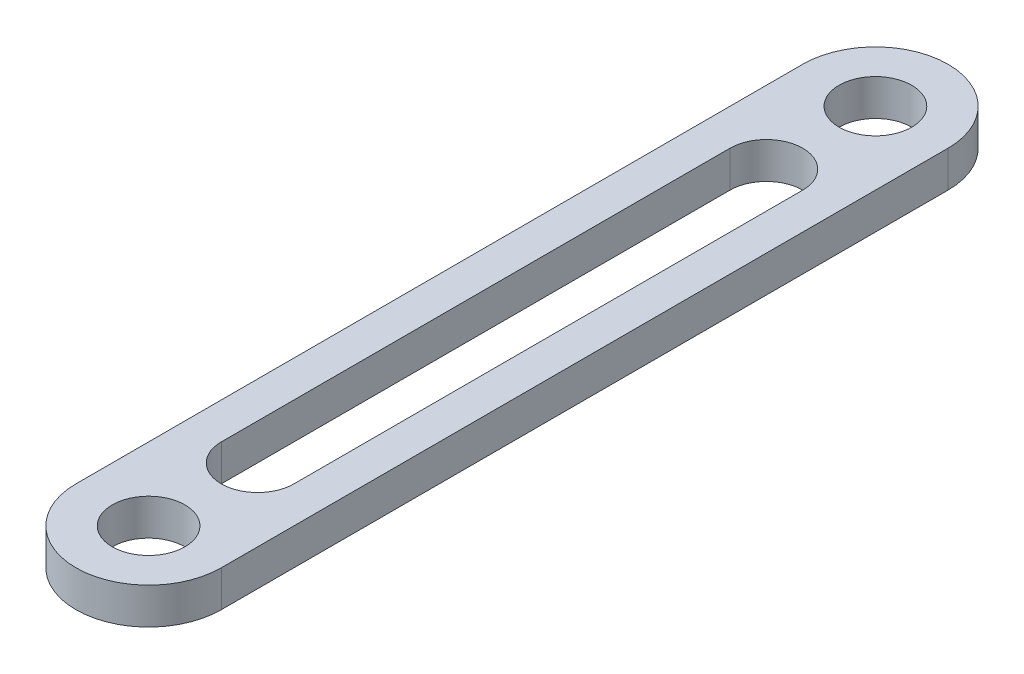
ISO-10303-21;
HEADER;
FILE_DESCRIPTION(('STEP AP214'),'2;1');
FILE_NAME('part.step','',(''),(''),'','','');
FILE_SCHEMA(('AUTOMOTIVE_DESIGN { 1 0 10303 214 1 1 1 1 }'));
ENDSEC;
DATA;
#1=APPLICATION_CONTEXT('core data for automotive mechanical design processes');
#2=APPLICATION_PROTOCOL_DEFINITION('international standard','automotive_design',2000,#1);
#3=PRODUCT_CONTEXT('',#1,'mechanical');
#4=PRODUCT('Part','Part','',(#3));
#5=PRODUCT_RELATED_PRODUCT_CATEGORY('part','',(#4));
#6=PRODUCT_DEFINITION_FORMATION('','',#4);
#7=PRODUCT_DEFINITION_CONTEXT('part definition',#1,'design');
#8=PRODUCT_DEFINITION('design','',#6,#7);
#9=PRODUCT_DEFINITION_SHAPE('','',#8);
#10=(LENGTH_UNIT() NAMED_UNIT(*) SI_UNIT(.MILLI.,.METRE.));
#11=(NAMED_UNIT(*) PLANE_ANGLE_UNIT() SI_UNIT($,.RADIAN.));
#12=(NAMED_UNIT(*) SI_UNIT($,.STERADIAN.) SOLID_ANGLE_UNIT());
#13=UNCERTAINTY_MEASURE_WITH_UNIT(LENGTH_MEASURE(1.E-05),#10,'distance_accuracy_value','');
#14=(GEOMETRIC_REPRESENTATION_CONTEXT(3) GLOBAL_UNCERTAINTY_ASSIGNED_CONTEXT((#13)) GLOBAL_UNIT_ASSIGNED_CONTEXT((#10,
#11,#12)) REPRESENTATION_CONTEXT('',''));
#15=CARTESIAN_POINT('',(0.,0.,0.));
#16=DIRECTION('',(0.,0.,1.));
#17=DIRECTION('',(1.,0.,0.));
#18=AXIS2_PLACEMENT_3D('',#15,#16,#17);
#19=CARTESIAN_POINT('',(0.,5.,0.));
#20=DIRECTION('',(0.,1.,0.));
#21=DIRECTION('',(0.,0.,1.));
#22=AXIS2_PLACEMENT_3D('',#19,#20,#21);
#23=PLANE('',#22);
#24=CARTESIAN_POINT('',(0.,5.,0.));
#25=DIRECTION('',(0.,1.,0.));
#26=DIRECTION('',(0.,0.,1.));
#27=AXIS2_PLACEMENT_3D('',#24,#25,#26);
#28=CIRCLE('',#27,5.);
#29=CARTESIAN_POINT('',(0.,5.,5.));
#30=VERTEX_POINT('',#29);
#31=EDGE_CURVE('E140',#30,#30,#28,.T.);
#32=ORIENTED_EDGE('',*,*,#31,.F.);
#33=EDGE_LOOP('',(#32));
#34=FACE_BOUND('',#33,.T.);
#35=CARTESIAN_POINT('',(0.,5.,0.));
#36=DIRECTION('',(0.,1.,0.));
#37=DIRECTION('',(0.,0.,1.));
#38=AXIS2_PLACEMENT_3D('',#35,#36,#37);
#39=CIRCLE('',#38,10.);
#40=CARTESIAN_POINT('',(10.,5.,0.));
#41=VERTEX_POINT('',#40);
#42=CARTESIAN_POINT('',(-10.,5.,0.));
#43=VERTEX_POINT('',#42);
#44=EDGE_CURVE('E156',#41,#43,#39,.T.);
#45=ORIENTED_EDGE('',*,*,#44,.T.);
#46=DIRECTION('',(0.,0.,1.));
#47=VECTOR('',#46,1.);
#48=CARTESIAN_POINT('',(-10.,5.,0.));
#49=LINE('',#48,#47);
#50=CARTESIAN_POINT('',(-9.99999999999999,5.,100.));
#51=VERTEX_POINT('',#50);
#52=EDGE_CURVE('E160',#43,#51,#49,.T.);
#53=ORIENTED_EDGE('',*,*,#52,.T.);
#54=CARTESIAN_POINT('',(0.,5.,100.));
#55=DIRECTION('',(0.,1.,0.));
#56=DIRECTION('',(0.,0.,1.));
#57=AXIS2_PLACEMENT_3D('',#54,#55,#56);
#58=CIRCLE('',#57,10.);
#59=CARTESIAN_POINT('',(10.,5.,100.));
#60=VERTEX_POINT('',#59);
#61=EDGE_CURVE('E164',#51,#60,#58,.T.);
#62=ORIENTED_EDGE('',*,*,#61,.T.);
#63=DIRECTION('',(0.,0.,-1.));
#64=VECTOR('',#63,1.);
#65=CARTESIAN_POINT('',(10.,5.,0.));
#66=LINE('',#65,#64);
#67=EDGE_CURVE('E167',#60,#41,#66,.T.);
#68=ORIENTED_EDGE('',*,*,#67,.T.);
#69=EDGE_LOOP('',(#45,#53,#62,#68));
#70=FACE_BOUND('',#69,.T.);
#71=DIRECTION('',(0.,0.,1.));
#72=VECTOR('',#71,1.);
#73=CARTESIAN_POINT('',(-5.,5.,15.));
#74=LINE('',#73,#72);
#75=CARTESIAN_POINT('',(-5.,5.,15.));
#76=VERTEX_POINT('',#75);
#77=CARTESIAN_POINT('',(-4.99999999999999,5.,85.));
#78=VERTEX_POINT('',#77);
#79=EDGE_CURVE('E114',#76,#78,#74,.T.);
#80=ORIENTED_EDGE('',*,*,#79,.F.);
#81=CARTESIAN_POINT('',(0.,5.,15.));
#82=DIRECTION('',(0.,1.,0.));
#83=DIRECTION('',(0.,0.,1.));
#84=AXIS2_PLACEMENT_3D('',#81,#82,#83);
#85=CIRCLE('',#84,5.);
#86=CARTESIAN_POINT('',(5.,5.,15.));
#87=VERTEX_POINT('',#86);
#88=EDGE_CURVE('E105',#87,#76,#85,.T.);
#89=ORIENTED_EDGE('',*,*,#88,.F.);
#90=DIRECTION('',(0.,0.,-1.));
#91=VECTOR('',#90,1.);
#92=CARTESIAN_POINT('',(5.,5.,15.));
#93=LINE('',#92,#91);
#94=CARTESIAN_POINT('',(5.00000000000001,5.,85.));
#95=VERTEX_POINT('',#94);
#96=EDGE_CURVE('E132',#95,#87,#93,.T.);
#97=ORIENTED_EDGE('',*,*,#96,.F.);
#98=CARTESIAN_POINT('',(0.,5.,85.));
#99=DIRECTION('',(0.,1.,0.));
#100=DIRECTION('',(0.,0.,1.));
#101=AXIS2_PLACEMENT_3D('',#98,#99,#100);
#102=CIRCLE('',#101,5.);
#103=EDGE_CURVE('E128',#78,#95,#102,.T.);
#104=ORIENTED_EDGE('',*,*,#103,.F.);
#105=EDGE_LOOP('',(#80,#89,#97,#104));
#106=FACE_BOUND('',#105,.T.);
#107=CARTESIAN_POINT('',(0.,5.,100.));
#108=DIRECTION('',(0.,1.,0.));
#109=DIRECTION('',(0.,0.,1.));
#110=AXIS2_PLACEMENT_3D('',#107,#108,#109);
#111=CIRCLE('',#110,5.);
#112=CARTESIAN_POINT('',(0.,5.,105.));
#113=VERTEX_POINT('',#112);
#114=EDGE_CURVE('E257',#113,#113,#111,.T.);
#115=ORIENTED_EDGE('',*,*,#114,.F.);
#116=EDGE_LOOP('',(#115));
#117=FACE_BOUND('',#116,.T.);
#118=ADVANCED_FACE('F39',(#34,#70,#106,#117),#23,.T.);
#119=CARTESIAN_POINT('',(0.,0.,0.));
#120=DIRECTION('',(0.,1.,0.));
#121=DIRECTION('',(0.,0.,1.));
#122=AXIS2_PLACEMENT_3D('',#119,#120,#121);
#123=PLANE('',#122);
#124=CARTESIAN_POINT('',(0.,0.,0.));
#125=DIRECTION('',(0.,1.,0.));
#126=DIRECTION('',(0.,0.,1.));
#127=AXIS2_PLACEMENT_3D('',#124,#125,#126);
#128=CIRCLE('',#127,10.);
#129=CARTESIAN_POINT('',(10.,0.,0.));
#130=VERTEX_POINT('',#129);
#131=CARTESIAN_POINT('',(-10.,0.,0.));
#132=VERTEX_POINT('',#131);
#133=EDGE_CURVE('E123',#130,#132,#128,.T.);
#134=ORIENTED_EDGE('',*,*,#133,.F.);
#135=DIRECTION('',(0.,0.,-1.));
#136=VECTOR('',#135,1.);
#137=CARTESIAN_POINT('',(10.,0.,0.));
#138=LINE('',#137,#136);
#139=CARTESIAN_POINT('',(10.,0.,100.));
#140=VERTEX_POINT('',#139);
#141=EDGE_CURVE('E161',#140,#130,#138,.T.);
#142=ORIENTED_EDGE('',*,*,#141,.F.);
#143=CARTESIAN_POINT('',(0.,0.,100.));
#144=DIRECTION('',(0.,1.,0.));
#145=DIRECTION('',(0.,0.,1.));
#146=AXIS2_PLACEMENT_3D('',#143,#144,#145);
#147=CIRCLE('',#146,10.);
#148=CARTESIAN_POINT('',(-9.99999999999999,0.,100.));
#149=VERTEX_POINT('',#148);
#150=EDGE_CURVE('E177',#149,#140,#147,.T.);
#151=ORIENTED_EDGE('',*,*,#150,.F.);
#152=DIRECTION('',(0.,0.,1.));
#153=VECTOR('',#152,1.);
#154=CARTESIAN_POINT('',(-10.,0.,0.));
#155=LINE('',#154,#153);
#156=EDGE_CURVE('E174',#132,#149,#155,.T.);
#157=ORIENTED_EDGE('',*,*,#156,.F.);
#158=EDGE_LOOP('',(#134,#142,#151,#157));
#159=FACE_BOUND('',#158,.T.);
#160=CARTESIAN_POINT('',(0.,0.,15.));
#161=DIRECTION('',(0.,1.,0.));
#162=DIRECTION('',(0.,0.,1.));
#163=AXIS2_PLACEMENT_3D('',#160,#161,#162);
#164=CIRCLE('',#163,5.);
#165=CARTESIAN_POINT('',(5.,0.,15.));
#166=VERTEX_POINT('',#165);
#167=CARTESIAN_POINT('',(-5.,0.,15.));
#168=VERTEX_POINT('',#167);
#169=EDGE_CURVE('E63',#166,#168,#164,.T.);
#170=ORIENTED_EDGE('',*,*,#169,.T.);
#171=DIRECTION('',(0.,0.,1.));
#172=VECTOR('',#171,1.);
#173=CARTESIAN_POINT('',(-5.,0.,15.));
#174=LINE('',#173,#172);
#175=CARTESIAN_POINT('',(-4.99999999999999,0.,85.));
#176=VERTEX_POINT('',#175);
#177=EDGE_CURVE('E121',#168,#176,#174,.T.);
#178=ORIENTED_EDGE('',*,*,#177,.T.);
#179=CARTESIAN_POINT('',(0.,0.,85.));
#180=DIRECTION('',(0.,1.,0.));
#181=DIRECTION('',(0.,0.,1.));
#182=AXIS2_PLACEMENT_3D('',#179,#180,#181);
#183=CIRCLE('',#182,5.);
#184=CARTESIAN_POINT('',(5.00000000000001,0.,85.));
#185=VERTEX_POINT('',#184);
#186=EDGE_CURVE('E143',#176,#185,#183,.T.);
#187=ORIENTED_EDGE('',*,*,#186,.T.);
#188=DIRECTION('',(0.,0.,-1.));
#189=VECTOR('',#188,1.);
#190=CARTESIAN_POINT('',(5.,0.,15.));
#191=LINE('',#190,#189);
#192=EDGE_CURVE('E115',#185,#166,#191,.T.);
#193=ORIENTED_EDGE('',*,*,#192,.T.);
#194=EDGE_LOOP('',(#170,#178,#187,#193));
#195=FACE_BOUND('',#194,.T.);
#196=CARTESIAN_POINT('',(0.,0.,0.));
#197=DIRECTION('',(0.,1.,0.));
#198=DIRECTION('',(0.,0.,1.));
#199=AXIS2_PLACEMENT_3D('',#196,#197,#198);
#200=CIRCLE('',#199,5.);
#201=CARTESIAN_POINT('',(0.,0.,5.));
#202=VERTEX_POINT('',#201);
#203=EDGE_CURVE('E265',#202,#202,#200,.T.);
#204=ORIENTED_EDGE('',*,*,#203,.T.);
#205=EDGE_LOOP('',(#204));
#206=FACE_BOUND('',#205,.T.);
#207=CARTESIAN_POINT('',(0.,0.,100.));
#208=DIRECTION('',(0.,1.,0.));
#209=DIRECTION('',(0.,0.,1.));
#210=AXIS2_PLACEMENT_3D('',#207,#208,#209);
#211=CIRCLE('',#210,5.);
#212=CARTESIAN_POINT('',(0.,0.,105.));
#213=VERTEX_POINT('',#212);
#214=EDGE_CURVE('E260',#213,#213,#211,.T.);
#215=ORIENTED_EDGE('',*,*,#214,.T.);
#216=EDGE_LOOP('',(#215));
#217=FACE_BOUND('',#216,.T.);
#218=ADVANCED_FACE('F200',(#159,#195,#206,#217),#123,.F.);
#219=CARTESIAN_POINT('',(0.,5.,0.));
#220=DIRECTION('',(0.,-1.,0.));
#221=DIRECTION('',(0.,0.,-1.));
#222=AXIS2_PLACEMENT_3D('',#219,#220,#221);
#223=CYLINDRICAL_SURFACE('',#222,10.);
#224=ORIENTED_EDGE('',*,*,#133,.T.);
#225=DIRECTION('',(0.,-1.,0.));
#226=VECTOR('',#225,1.);
#227=CARTESIAN_POINT('',(-10.,5.,0.));
#228=LINE('',#227,#226);
#229=EDGE_CURVE('E11',#43,#132,#228,.T.);
#230=ORIENTED_EDGE('',*,*,#229,.F.);
#231=ORIENTED_EDGE('',*,*,#44,.F.);
#232=DIRECTION('',(0.,-1.,0.));
#233=VECTOR('',#232,1.);
#234=CARTESIAN_POINT('',(10.,5.,0.));
#235=LINE('',#234,#233);
#236=EDGE_CURVE('E170',#41,#130,#235,.T.);
#237=ORIENTED_EDGE('',*,*,#236,.T.);
#238=EDGE_LOOP('',(#224,#230,#231,#237));
#239=FACE_BOUND('',#238,.T.);
#240=ADVANCED_FACE('F41',(#239),#223,.T.);
#241=CARTESIAN_POINT('',(-10.,5.,0.));
#242=DIRECTION('',(1.,0.,0.));
#243=DIRECTION('',(0.,0.,-1.));
#244=AXIS2_PLACEMENT_3D('',#241,#242,#243);
#245=PLANE('',#244);
#246=ORIENTED_EDGE('',*,*,#156,.T.);
#247=DIRECTION('',(0.,-1.,0.));
#248=VECTOR('',#247,1.);
#249=CARTESIAN_POINT('',(-9.99999999999999,5.,100.));
#250=LINE('',#249,#248);
#251=EDGE_CURVE('E48',#51,#149,#250,.T.);
#252=ORIENTED_EDGE('',*,*,#251,.F.);
#253=ORIENTED_EDGE('',*,*,#52,.F.);
#254=ORIENTED_EDGE('',*,*,#229,.T.);
#255=EDGE_LOOP('',(#246,#252,#253,#254));
#256=FACE_BOUND('',#255,.T.);
#257=ADVANCED_FACE('F210',(#256),#245,.F.);
#258=CARTESIAN_POINT('',(0.,5.,100.));
#259=DIRECTION('',(0.,-1.,0.));
#260=DIRECTION('',(0.,0.,-1.));
#261=AXIS2_PLACEMENT_3D('',#258,#259,#260);
#262=CYLINDRICAL_SURFACE('',#261,10.);
#263=ORIENTED_EDGE('',*,*,#150,.T.);
#264=DIRECTION('',(0.,-1.,0.));
#265=VECTOR('',#264,1.);
#266=CARTESIAN_POINT('',(10.,5.,100.));
#267=LINE('',#266,#265);
#268=EDGE_CURVE('E185',#60,#140,#267,.T.);
#269=ORIENTED_EDGE('',*,*,#268,.F.);
#270=ORIENTED_EDGE('',*,*,#61,.F.);
#271=ORIENTED_EDGE('',*,*,#251,.T.);
#272=EDGE_LOOP('',(#263,#269,#270,#271));
#273=FACE_BOUND('',#272,.T.);
#274=ADVANCED_FACE('F194',(#273),#262,.T.);
#275=CARTESIAN_POINT('',(10.,5.,0.));
#276=DIRECTION('',(-1.,0.,0.));
#277=DIRECTION('',(0.,0.,1.));
#278=AXIS2_PLACEMENT_3D('',#275,#276,#277);
#279=PLANE('',#278);
#280=ORIENTED_EDGE('',*,*,#141,.T.);
#281=ORIENTED_EDGE('',*,*,#236,.F.);
#282=ORIENTED_EDGE('',*,*,#67,.F.);
#283=ORIENTED_EDGE('',*,*,#268,.T.);
#284=EDGE_LOOP('',(#280,#281,#282,#283));
#285=FACE_BOUND('',#284,.T.);
#286=ADVANCED_FACE('F204',(#285),#279,.F.);
#287=CARTESIAN_POINT('',(0.,5.,15.));
#288=DIRECTION('',(0.,-1.,0.));
#289=DIRECTION('',(0.,0.,-1.));
#290=AXIS2_PLACEMENT_3D('',#287,#288,#289);
#291=CYLINDRICAL_SURFACE('',#290,5.);
#292=ORIENTED_EDGE('',*,*,#169,.F.);
#293=DIRECTION('',(0.,-1.,0.));
#294=VECTOR('',#293,1.);
#295=CARTESIAN_POINT('',(5.,5.,15.));
#296=LINE('',#295,#294);
#297=EDGE_CURVE('E109',#87,#166,#296,.T.);
#298=ORIENTED_EDGE('',*,*,#297,.F.);
#299=ORIENTED_EDGE('',*,*,#88,.T.);
#300=DIRECTION('',(0.,-1.,0.));
#301=VECTOR('',#300,1.);
#302=CARTESIAN_POINT('',(-5.,5.,15.));
#303=LINE('',#302,#301);
#304=EDGE_CURVE('E108',#76,#168,#303,.T.);
#305=ORIENTED_EDGE('',*,*,#304,.T.);
#306=EDGE_LOOP('',(#292,#298,#299,#305));
#307=FACE_BOUND('',#306,.T.);
#308=ADVANCED_FACE('F107',(#307),#291,.F.);
#309=CARTESIAN_POINT('',(-5.,5.,15.));
#310=DIRECTION('',(1.,0.,0.));
#311=DIRECTION('',(0.,0.,-1.));
#312=AXIS2_PLACEMENT_3D('',#309,#310,#311);
#313=PLANE('',#312);
#314=ORIENTED_EDGE('',*,*,#177,.F.);
#315=ORIENTED_EDGE('',*,*,#304,.F.);
#316=ORIENTED_EDGE('',*,*,#79,.T.);
#317=DIRECTION('',(0.,-1.,0.));
#318=VECTOR('',#317,1.);
#319=CARTESIAN_POINT('',(-4.99999999999999,5.,85.));
#320=LINE('',#319,#318);
#321=EDGE_CURVE('E124',#78,#176,#320,.T.);
#322=ORIENTED_EDGE('',*,*,#321,.T.);
#323=EDGE_LOOP('',(#314,#315,#316,#322));
#324=FACE_BOUND('',#323,.T.);
#325=ADVANCED_FACE('F118',(#324),#313,.T.);
#326=CARTESIAN_POINT('',(0.,5.,85.));
#327=DIRECTION('',(0.,-1.,0.));
#328=DIRECTION('',(0.,0.,-1.));
#329=AXIS2_PLACEMENT_3D('',#326,#327,#328);
#330=CYLINDRICAL_SURFACE('',#329,5.);
#331=ORIENTED_EDGE('',*,*,#186,.F.);
#332=ORIENTED_EDGE('',*,*,#321,.F.);
#333=ORIENTED_EDGE('',*,*,#103,.T.);
#334=DIRECTION('',(0.,-1.,0.));
#335=VECTOR('',#334,1.);
#336=CARTESIAN_POINT('',(5.00000000000001,5.,85.));
#337=LINE('',#336,#335);
#338=EDGE_CURVE('E55',#95,#185,#337,.T.);
#339=ORIENTED_EDGE('',*,*,#338,.T.);
#340=EDGE_LOOP('',(#331,#332,#333,#339));
#341=FACE_BOUND('',#340,.T.);
#342=ADVANCED_FACE('F235',(#341),#330,.F.);
#343=CARTESIAN_POINT('',(5.,5.,15.));
#344=DIRECTION('',(-1.,0.,0.));
#345=DIRECTION('',(0.,0.,1.));
#346=AXIS2_PLACEMENT_3D('',#343,#344,#345);
#347=PLANE('',#346);
#348=ORIENTED_EDGE('',*,*,#192,.F.);
#349=ORIENTED_EDGE('',*,*,#338,.F.);
#350=ORIENTED_EDGE('',*,*,#96,.T.);
#351=ORIENTED_EDGE('',*,*,#297,.T.);
#352=EDGE_LOOP('',(#348,#349,#350,#351));
#353=FACE_BOUND('',#352,.T.);
#354=ADVANCED_FACE('F239',(#353),#347,.T.);
#355=CARTESIAN_POINT('',(0.,5.,0.));
#356=DIRECTION('',(0.,-1.,0.));
#357=DIRECTION('',(0.,0.,-1.));
#358=AXIS2_PLACEMENT_3D('',#355,#356,#357);
#359=CYLINDRICAL_SURFACE('',#358,5.);
#360=ORIENTED_EDGE('',*,*,#31,.T.);
#361=EDGE_LOOP('',(#360));
#362=FACE_BOUND('',#361,.T.);
#363=ORIENTED_EDGE('',*,*,#203,.F.);
#364=EDGE_LOOP('',(#363));
#365=FACE_BOUND('',#364,.T.);
#366=ADVANCED_FACE('F245',(#362,#365),#359,.F.);
#367=CARTESIAN_POINT('',(0.,5.,100.));
#368=DIRECTION('',(0.,-1.,0.));
#369=DIRECTION('',(0.,0.,-1.));
#370=AXIS2_PLACEMENT_3D('',#367,#368,#369);
#371=CYLINDRICAL_SURFACE('',#370,5.);
#372=ORIENTED_EDGE('',*,*,#114,.T.);
#373=EDGE_LOOP('',(#372));
#374=FACE_BOUND('',#373,.T.);
#375=ORIENTED_EDGE('',*,*,#214,.F.);
#376=EDGE_LOOP('',(#375));
#377=FACE_BOUND('',#376,.T.);
#378=ADVANCED_FACE('F248',(#374,#377),#371,.F.);
#379=CLOSED_SHELL('',(#118,#218,#240,#257,#274,#286,#308,#325,#342,#354,#366,#378));
#380=MANIFOLD_SOLID_BREP('B2',#379);
#381=ADVANCED_BREP_SHAPE_REPRESENTATION('',(#18,#380),#14);
#382=SHAPE_DEFINITION_REPRESENTATION(#9,#381);
ENDSEC;
END-ISO-10303-21;
